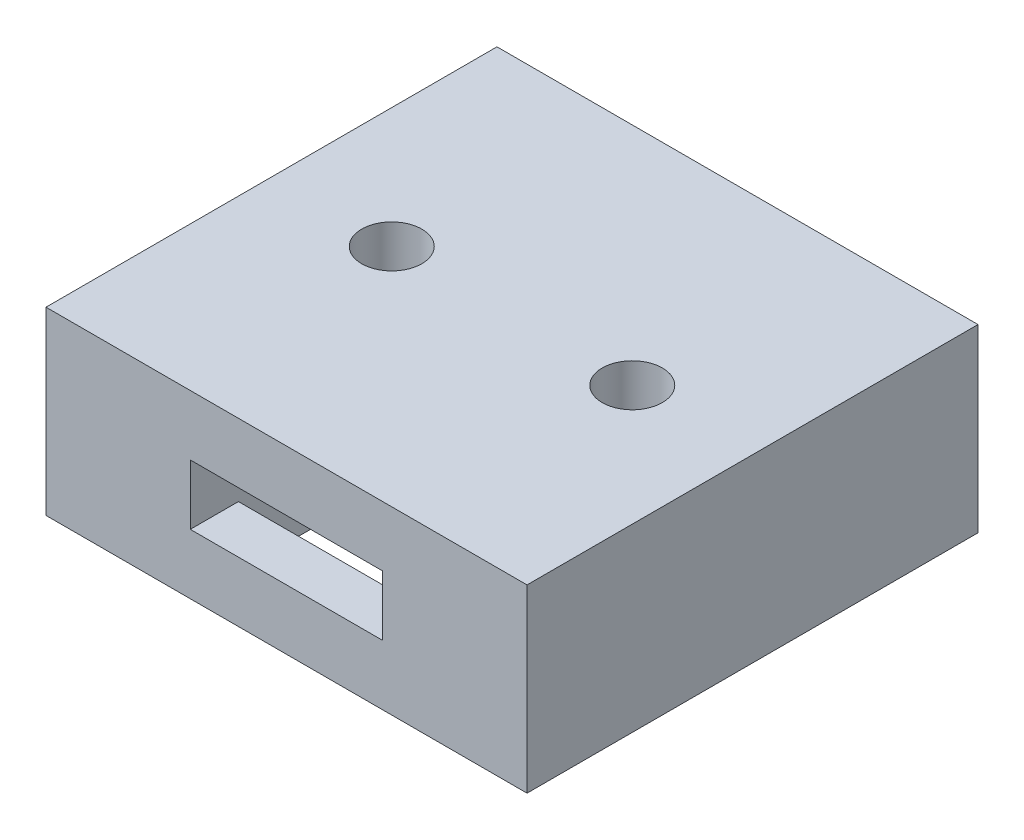
ISO-10303-21;
HEADER;
FILE_DESCRIPTION(('STEP AP214'),'2;1');
FILE_NAME('part.step','',(''),(''),'','','');
FILE_SCHEMA(('AUTOMOTIVE_DESIGN { 1 0 10303 214 1 1 1 1 }'));
ENDSEC;
DATA;
#1=APPLICATION_CONTEXT('core data for automotive mechanical design processes');
#2=APPLICATION_PROTOCOL_DEFINITION('international standard','automotive_design',2000,#1);
#3=PRODUCT_CONTEXT('',#1,'mechanical');
#4=PRODUCT('Part','Part','',(#3));
#5=PRODUCT_RELATED_PRODUCT_CATEGORY('part','',(#4));
#6=PRODUCT_DEFINITION_FORMATION('','',#4);
#7=PRODUCT_DEFINITION_CONTEXT('part definition',#1,'design');
#8=PRODUCT_DEFINITION('design','',#6,#7);
#9=PRODUCT_DEFINITION_SHAPE('','',#8);
#10=(LENGTH_UNIT() NAMED_UNIT(*) SI_UNIT(.MILLI.,.METRE.));
#11=(NAMED_UNIT(*) PLANE_ANGLE_UNIT() SI_UNIT($,.RADIAN.));
#12=(NAMED_UNIT(*) SI_UNIT($,.STERADIAN.) SOLID_ANGLE_UNIT());
#13=UNCERTAINTY_MEASURE_WITH_UNIT(LENGTH_MEASURE(1.E-05),#10,'distance_accuracy_value','');
#14=(GEOMETRIC_REPRESENTATION_CONTEXT(3) GLOBAL_UNCERTAINTY_ASSIGNED_CONTEXT((#13)) GLOBAL_UNIT_ASSIGNED_CONTEXT((#10,
#11,#12)) REPRESENTATION_CONTEXT('',''));
#15=CARTESIAN_POINT('',(0.,0.,0.));
#16=DIRECTION('',(0.,0.,1.));
#17=DIRECTION('',(1.,0.,0.));
#18=AXIS2_PLACEMENT_3D('',#15,#16,#17);
#19=CARTESIAN_POINT('',(-3.2,-26.,4.9));
#20=DIRECTION('',(-1.,0.,0.));
#21=DIRECTION('',(0.,0.,1.));
#22=AXIS2_PLACEMENT_3D('',#19,#20,#21);
#23=PLANE('',#22);
#24=DIRECTION('',(0.,1.,0.));
#25=VECTOR('',#24,1.);
#26=CARTESIAN_POINT('',(-3.2,-26.,2.9));
#27=LINE('',#26,#25);
#28=CARTESIAN_POINT('',(-3.2,0.,2.9));
#29=VERTEX_POINT('',#28);
#30=CARTESIAN_POINT('',(-3.2,4.,2.9));
#31=VERTEX_POINT('',#30);
#32=EDGE_CURVE('E186',#29,#31,#27,.T.);
#33=ORIENTED_EDGE('',*,*,#32,.T.);
#34=DIRECTION('',(0.,0.,1.));
#35=VECTOR('',#34,1.);
#36=CARTESIAN_POINT('',(-3.2,4.,2.9));
#37=LINE('',#36,#35);
#38=CARTESIAN_POINT('',(-3.2,4.,7.5));
#39=VERTEX_POINT('',#38);
#40=EDGE_CURVE('E171',#31,#39,#37,.T.);
#41=ORIENTED_EDGE('',*,*,#40,.T.);
#42=DIRECTION('',(0.,1.,0.));
#43=VECTOR('',#42,1.);
#44=CARTESIAN_POINT('',(-3.2,2.,7.5));
#45=LINE('',#44,#43);
#46=CARTESIAN_POINT('',(-3.2,2.,7.5));
#47=VERTEX_POINT('',#46);
#48=EDGE_CURVE('E301',#47,#39,#45,.T.);
#49=ORIENTED_EDGE('',*,*,#48,.F.);
#50=DIRECTION('',(0.,0.,1.));
#51=VECTOR('',#50,1.);
#52=CARTESIAN_POINT('',(-3.2,2.,2.9));
#53=LINE('',#52,#51);
#54=CARTESIAN_POINT('',(-3.2,2.,5.9));
#55=VERTEX_POINT('',#54);
#56=EDGE_CURVE('E315',#55,#47,#53,.T.);
#57=ORIENTED_EDGE('',*,*,#56,.F.);
#58=DIRECTION('',(0.,-0.707106781186548,-0.707106781186547));
#59=VECTOR('',#58,1.);
#60=CARTESIAN_POINT('',(-3.2,-12.5,-8.6));
#61=LINE('',#60,#59);
#62=CARTESIAN_POINT('',(-3.2,1.,4.9));
#63=VERTEX_POINT('',#62);
#64=EDGE_CURVE('E44',#55,#63,#61,.T.);
#65=ORIENTED_EDGE('',*,*,#64,.T.);
#66=DIRECTION('',(0.,1.,0.));
#67=VECTOR('',#66,1.);
#68=CARTESIAN_POINT('',(-3.2,-26.,4.9));
#69=LINE('',#68,#67);
#70=CARTESIAN_POINT('',(-3.2,0.,4.9));
#71=VERTEX_POINT('',#70);
#72=EDGE_CURVE('E189',#71,#63,#69,.T.);
#73=ORIENTED_EDGE('',*,*,#72,.F.);
#74=DIRECTION('',(0.,0.,-1.));
#75=VECTOR('',#74,1.);
#76=CARTESIAN_POINT('',(-3.2,0.,0.));
#77=LINE('',#76,#75);
#78=EDGE_CURVE('E260',#71,#29,#77,.T.);
#79=ORIENTED_EDGE('',*,*,#78,.T.);
#80=EDGE_LOOP('',(#33,#41,#49,#57,#65,#73,#79));
#81=FACE_BOUND('',#80,.T.);
#82=ADVANCED_FACE('F35',(#81),#23,.F.);
#83=CARTESIAN_POINT('',(3.2,-26.,2.9));
#84=DIRECTION('',(0.,0.,-1.));
#85=DIRECTION('',(-1.,0.,0.));
#86=AXIS2_PLACEMENT_3D('',#83,#84,#85);
#87=PLANE('',#86);
#88=DIRECTION('',(-1.,0.,0.));
#89=VECTOR('',#88,1.);
#90=CARTESIAN_POINT('',(-3.2,4.,2.9));
#91=LINE('',#90,#89);
#92=CARTESIAN_POINT('',(3.2,4.,2.9));
#93=VERTEX_POINT('',#92);
#94=EDGE_CURVE('E175',#93,#31,#91,.T.);
#95=ORIENTED_EDGE('',*,*,#94,.T.);
#96=ORIENTED_EDGE('',*,*,#32,.F.);
#97=DIRECTION('',(1.,0.,0.));
#98=VECTOR('',#97,1.);
#99=CARTESIAN_POINT('',(0.,0.,2.9));
#100=LINE('',#99,#98);
#101=CARTESIAN_POINT('',(3.2,0.,2.9));
#102=VERTEX_POINT('',#101);
#103=EDGE_CURVE('E184',#29,#102,#100,.T.);
#104=ORIENTED_EDGE('',*,*,#103,.T.);
#105=DIRECTION('',(0.,1.,0.));
#106=VECTOR('',#105,1.);
#107=CARTESIAN_POINT('',(3.2,-26.,2.9));
#108=LINE('',#107,#106);
#109=EDGE_CURVE('E164',#102,#93,#108,.T.);
#110=ORIENTED_EDGE('',*,*,#109,.T.);
#111=EDGE_LOOP('',(#95,#96,#104,#110));
#112=FACE_BOUND('',#111,.T.);
#113=ADVANCED_FACE('F182',(#112),#87,.F.);
#114=CARTESIAN_POINT('',(3.2,-26.,4.89999999999999));
#115=DIRECTION('',(1.,0.,0.));
#116=DIRECTION('',(0.,0.,-1.));
#117=AXIS2_PLACEMENT_3D('',#114,#115,#116);
#118=PLANE('',#117);
#119=DIRECTION('',(0.,0.,1.));
#120=VECTOR('',#119,1.);
#121=CARTESIAN_POINT('',(3.2,4.,2.9));
#122=LINE('',#121,#120);
#123=CARTESIAN_POINT('',(3.2,4.,7.5));
#124=VERTEX_POINT('',#123);
#125=EDGE_CURVE('E160',#93,#124,#122,.T.);
#126=ORIENTED_EDGE('',*,*,#125,.F.);
#127=ORIENTED_EDGE('',*,*,#109,.F.);
#128=DIRECTION('',(0.,0.,1.));
#129=VECTOR('',#128,1.);
#130=CARTESIAN_POINT('',(3.2,0.,0.));
#131=LINE('',#130,#129);
#132=CARTESIAN_POINT('',(3.2,0.,4.89999999999999));
#133=VERTEX_POINT('',#132);
#134=EDGE_CURVE('E257',#102,#133,#131,.T.);
#135=ORIENTED_EDGE('',*,*,#134,.T.);
#136=DIRECTION('',(0.,1.,0.));
#137=VECTOR('',#136,1.);
#138=CARTESIAN_POINT('',(3.2,-26.,4.89999999999999));
#139=LINE('',#138,#137);
#140=CARTESIAN_POINT('',(3.2,1.,4.89999999999999));
#141=VERTEX_POINT('',#140);
#142=EDGE_CURVE('E187',#133,#141,#139,.T.);
#143=ORIENTED_EDGE('',*,*,#142,.T.);
#144=DIRECTION('',(0.,0.707106781186548,0.707106781186547));
#145=VECTOR('',#144,1.);
#146=CARTESIAN_POINT('',(3.2,-12.5,-8.60000000000001));
#147=LINE('',#146,#145);
#148=CARTESIAN_POINT('',(3.2,2.,5.89999999999999));
#149=VERTEX_POINT('',#148);
#150=EDGE_CURVE('E11',#141,#149,#147,.T.);
#151=ORIENTED_EDGE('',*,*,#150,.T.);
#152=DIRECTION('',(0.,0.,1.));
#153=VECTOR('',#152,1.);
#154=CARTESIAN_POINT('',(3.2,2.,2.9));
#155=LINE('',#154,#153);
#156=CARTESIAN_POINT('',(3.2,2.,7.5));
#157=VERTEX_POINT('',#156);
#158=EDGE_CURVE('E172',#149,#157,#155,.T.);
#159=ORIENTED_EDGE('',*,*,#158,.T.);
#160=DIRECTION('',(0.,-1.,0.));
#161=VECTOR('',#160,1.);
#162=CARTESIAN_POINT('',(3.2,2.,7.5));
#163=LINE('',#162,#161);
#164=EDGE_CURVE('E167',#124,#157,#163,.T.);
#165=ORIENTED_EDGE('',*,*,#164,.F.);
#166=EDGE_LOOP('',(#126,#127,#135,#143,#151,#159,#165));
#167=FACE_BOUND('',#166,.T.);
#168=ADVANCED_FACE('F162',(#167),#118,.F.);
#169=CARTESIAN_POINT('',(3.2,-26.,-4.9));
#170=DIRECTION('',(1.,0.,0.));
#171=DIRECTION('',(0.,0.,-1.));
#172=AXIS2_PLACEMENT_3D('',#169,#170,#171);
#173=PLANE('',#172);
#174=DIRECTION('',(0.,1.,0.));
#175=VECTOR('',#174,1.);
#176=CARTESIAN_POINT('',(3.2,-26.,-2.9));
#177=LINE('',#176,#175);
#178=CARTESIAN_POINT('',(3.2,0.,-2.9));
#179=VERTEX_POINT('',#178);
#180=CARTESIAN_POINT('',(3.2,4.,-2.9));
#181=VERTEX_POINT('',#180);
#182=EDGE_CURVE('E191',#179,#181,#177,.T.);
#183=ORIENTED_EDGE('',*,*,#182,.T.);
#184=DIRECTION('',(0.,0.,-1.));
#185=VECTOR('',#184,1.);
#186=CARTESIAN_POINT('',(3.2,4.,-2.9));
#187=LINE('',#186,#185);
#188=CARTESIAN_POINT('',(3.2,4.,-7.5));
#189=VERTEX_POINT('',#188);
#190=EDGE_CURVE('E306',#181,#189,#187,.T.);
#191=ORIENTED_EDGE('',*,*,#190,.T.);
#192=DIRECTION('',(0.,-1.,0.));
#193=VECTOR('',#192,1.);
#194=CARTESIAN_POINT('',(3.2,2.,-7.5));
#195=LINE('',#194,#193);
#196=CARTESIAN_POINT('',(3.2,2.,-7.5));
#197=VERTEX_POINT('',#196);
#198=EDGE_CURVE('E572',#189,#197,#195,.T.);
#199=ORIENTED_EDGE('',*,*,#198,.T.);
#200=DIRECTION('',(0.,0.,-1.));
#201=VECTOR('',#200,1.);
#202=CARTESIAN_POINT('',(3.2,2.,-2.9));
#203=LINE('',#202,#201);
#204=CARTESIAN_POINT('',(3.2,2.,-5.9));
#205=VERTEX_POINT('',#204);
#206=EDGE_CURVE('E283',#205,#197,#203,.T.);
#207=ORIENTED_EDGE('',*,*,#206,.F.);
#208=DIRECTION('',(0.,0.707106781186545,-0.70710678118655));
#209=VECTOR('',#208,1.);
#210=CARTESIAN_POINT('',(3.2,-12.4999999999999,8.6));
#211=LINE('',#210,#209);
#212=CARTESIAN_POINT('',(3.2,1.00000000000001,-4.9));
#213=VERTEX_POINT('',#212);
#214=EDGE_CURVE('E275',#205,#213,#211,.F.);
#215=ORIENTED_EDGE('',*,*,#214,.T.);
#216=DIRECTION('',(0.,1.,0.));
#217=VECTOR('',#216,1.);
#218=CARTESIAN_POINT('',(3.2,-26.,-4.9));
#219=LINE('',#218,#217);
#220=CARTESIAN_POINT('',(3.2,0.,-4.9));
#221=VERTEX_POINT('',#220);
#222=EDGE_CURVE('E203',#221,#213,#219,.T.);
#223=ORIENTED_EDGE('',*,*,#222,.F.);
#224=DIRECTION('',(0.,0.,1.));
#225=VECTOR('',#224,1.);
#226=CARTESIAN_POINT('',(3.2,0.,0.));
#227=LINE('',#226,#225);
#228=EDGE_CURVE('E255',#221,#179,#227,.T.);
#229=ORIENTED_EDGE('',*,*,#228,.T.);
#230=EDGE_LOOP('',(#183,#191,#199,#207,#215,#223,#229));
#231=FACE_BOUND('',#230,.T.);
#232=ADVANCED_FACE('F280',(#231),#173,.F.);
#233=CARTESIAN_POINT('',(3.2,-26.,-2.9));
#234=DIRECTION('',(0.,0.,1.));
#235=DIRECTION('',(1.,0.,0.));
#236=AXIS2_PLACEMENT_3D('',#233,#234,#235);
#237=PLANE('',#236);
#238=DIRECTION('',(1.,0.,0.));
#239=VECTOR('',#238,1.);
#240=CARTESIAN_POINT('',(-3.2,4.,-2.9));
#241=LINE('',#240,#239);
#242=CARTESIAN_POINT('',(-3.2,4.,-2.9));
#243=VERTEX_POINT('',#242);
#244=EDGE_CURVE('E180',#243,#181,#241,.T.);
#245=ORIENTED_EDGE('',*,*,#244,.T.);
#246=ORIENTED_EDGE('',*,*,#182,.F.);
#247=DIRECTION('',(-1.,0.,0.));
#248=VECTOR('',#247,1.);
#249=CARTESIAN_POINT('',(0.,0.,-2.9));
#250=LINE('',#249,#248);
#251=CARTESIAN_POINT('',(-3.2,0.,-2.9));
#252=VERTEX_POINT('',#251);
#253=EDGE_CURVE('E253',#179,#252,#250,.T.);
#254=ORIENTED_EDGE('',*,*,#253,.T.);
#255=DIRECTION('',(0.,1.,0.));
#256=VECTOR('',#255,1.);
#257=CARTESIAN_POINT('',(-3.2,-26.,-2.9));
#258=LINE('',#257,#256);
#259=EDGE_CURVE('E197',#252,#243,#258,.T.);
#260=ORIENTED_EDGE('',*,*,#259,.T.);
#261=EDGE_LOOP('',(#245,#246,#254,#260));
#262=FACE_BOUND('',#261,.T.);
#263=ADVANCED_FACE('F374',(#262),#237,.F.);
#264=CARTESIAN_POINT('',(-3.2,-26.,-4.9));
#265=DIRECTION('',(-1.,0.,0.));
#266=DIRECTION('',(0.,0.,1.));
#267=AXIS2_PLACEMENT_3D('',#264,#265,#266);
#268=PLANE('',#267);
#269=DIRECTION('',(0.,0.,-1.));
#270=VECTOR('',#269,1.);
#271=CARTESIAN_POINT('',(-3.2,4.,-2.9));
#272=LINE('',#271,#270);
#273=CARTESIAN_POINT('',(-3.2,4.,-7.5));
#274=VERTEX_POINT('',#273);
#275=EDGE_CURVE('E574',#243,#274,#272,.T.);
#276=ORIENTED_EDGE('',*,*,#275,.F.);
#277=ORIENTED_EDGE('',*,*,#259,.F.);
#278=DIRECTION('',(0.,0.,-1.));
#279=VECTOR('',#278,1.);
#280=CARTESIAN_POINT('',(-3.2,0.,0.));
#281=LINE('',#280,#279);
#282=CARTESIAN_POINT('',(-3.2,0.,-4.9));
#283=VERTEX_POINT('',#282);
#284=EDGE_CURVE('E250',#252,#283,#281,.T.);
#285=ORIENTED_EDGE('',*,*,#284,.T.);
#286=DIRECTION('',(0.,1.,0.));
#287=VECTOR('',#286,1.);
#288=CARTESIAN_POINT('',(-3.2,-26.,-4.9));
#289=LINE('',#288,#287);
#290=CARTESIAN_POINT('',(-3.2,1.00000000000001,-4.9));
#291=VERTEX_POINT('',#290);
#292=EDGE_CURVE('E200',#283,#291,#289,.T.);
#293=ORIENTED_EDGE('',*,*,#292,.T.);
#294=DIRECTION('',(0.,-0.707106781186545,0.70710678118655));
#295=VECTOR('',#294,1.);
#296=CARTESIAN_POINT('',(-3.19999999999999,-12.4999999999999,8.6));
#297=LINE('',#296,#295);
#298=CARTESIAN_POINT('',(-3.2,2.,-5.9));
#299=VERTEX_POINT('',#298);
#300=EDGE_CURVE('E273',#291,#299,#297,.F.);
#301=ORIENTED_EDGE('',*,*,#300,.T.);
#302=DIRECTION('',(0.,0.,-1.));
#303=VECTOR('',#302,1.);
#304=CARTESIAN_POINT('',(-3.2,2.,-2.9));
#305=LINE('',#304,#303);
#306=CARTESIAN_POINT('',(-3.2,2.,-7.5));
#307=VERTEX_POINT('',#306);
#308=EDGE_CURVE('E294',#299,#307,#305,.T.);
#309=ORIENTED_EDGE('',*,*,#308,.T.);
#310=DIRECTION('',(0.,1.,0.));
#311=VECTOR('',#310,1.);
#312=CARTESIAN_POINT('',(-3.2,2.,-7.5));
#313=LINE('',#312,#311);
#314=EDGE_CURVE('E571',#307,#274,#313,.T.);
#315=ORIENTED_EDGE('',*,*,#314,.T.);
#316=EDGE_LOOP('',(#276,#277,#285,#293,#301,#309,#315));
#317=FACE_BOUND('',#316,.T.);
#318=ADVANCED_FACE('F293',(#317),#268,.F.);
#319=CARTESIAN_POINT('',(3.2,-26.,-4.9));
#320=DIRECTION('',(0.,0.,-1.));
#321=DIRECTION('',(-1.,0.,0.));
#322=AXIS2_PLACEMENT_3D('',#319,#320,#321);
#323=PLANE('',#322);
#324=ORIENTED_EDGE('',*,*,#222,.T.);
#325=DIRECTION('',(-1.,0.,0.));
#326=VECTOR('',#325,1.);
#327=CARTESIAN_POINT('',(3.2,1.00000000000001,-4.9));
#328=LINE('',#327,#326);
#329=EDGE_CURVE('E264',#213,#291,#328,.T.);
#330=ORIENTED_EDGE('',*,*,#329,.T.);
#331=ORIENTED_EDGE('',*,*,#292,.F.);
#332=DIRECTION('',(1.,0.,0.));
#333=VECTOR('',#332,1.);
#334=CARTESIAN_POINT('',(0.,0.,-4.9));
#335=LINE('',#334,#333);
#336=EDGE_CURVE('E248',#283,#221,#335,.T.);
#337=ORIENTED_EDGE('',*,*,#336,.T.);
#338=EDGE_LOOP('',(#324,#330,#331,#337));
#339=FACE_BOUND('',#338,.T.);
#340=ADVANCED_FACE('F288',(#339),#323,.F.);
#341=CARTESIAN_POINT('',(8.,6.,7.5));
#342=DIRECTION('',(0.,0.,-1.));
#343=DIRECTION('',(-1.,0.,0.));
#344=AXIS2_PLACEMENT_3D('',#341,#342,#343);
#345=PLANE('',#344);
#346=DIRECTION('',(1.,0.,0.));
#347=VECTOR('',#346,1.);
#348=CARTESIAN_POINT('',(8.,0.,7.5));
#349=LINE('',#348,#347);
#350=CARTESIAN_POINT('',(-8.,0.,7.5));
#351=VERTEX_POINT('',#350);
#352=CARTESIAN_POINT('',(8.,0.,7.5));
#353=VERTEX_POINT('',#352);
#354=EDGE_CURVE('E232',#351,#353,#349,.T.);
#355=ORIENTED_EDGE('',*,*,#354,.T.);
#356=DIRECTION('',(0.,-1.,0.));
#357=VECTOR('',#356,1.);
#358=CARTESIAN_POINT('',(8.,6.,7.5));
#359=LINE('',#358,#357);
#360=CARTESIAN_POINT('',(8.,6.,7.5));
#361=VERTEX_POINT('',#360);
#362=EDGE_CURVE('E242',#361,#353,#359,.T.);
#363=ORIENTED_EDGE('',*,*,#362,.F.);
#364=DIRECTION('',(1.,0.,0.));
#365=VECTOR('',#364,1.);
#366=CARTESIAN_POINT('',(8.,6.,7.5));
#367=LINE('',#366,#365);
#368=CARTESIAN_POINT('',(-8.,6.,7.5));
#369=VERTEX_POINT('',#368);
#370=EDGE_CURVE('E222',#369,#361,#367,.T.);
#371=ORIENTED_EDGE('',*,*,#370,.F.);
#372=DIRECTION('',(0.,-1.,0.));
#373=VECTOR('',#372,1.);
#374=CARTESIAN_POINT('',(-8.,6.,7.5));
#375=LINE('',#374,#373);
#376=EDGE_CURVE('E245',#369,#351,#375,.T.);
#377=ORIENTED_EDGE('',*,*,#376,.T.);
#378=EDGE_LOOP('',(#355,#363,#371,#377));
#379=FACE_BOUND('',#378,.T.);
#380=ORIENTED_EDGE('',*,*,#48,.T.);
#381=DIRECTION('',(1.,0.,0.));
#382=VECTOR('',#381,1.);
#383=CARTESIAN_POINT('',(-3.2,4.,7.5));
#384=LINE('',#383,#382);
#385=EDGE_CURVE('E304',#39,#124,#384,.T.);
#386=ORIENTED_EDGE('',*,*,#385,.T.);
#387=ORIENTED_EDGE('',*,*,#164,.T.);
#388=DIRECTION('',(-1.,0.,0.));
#389=VECTOR('',#388,1.);
#390=CARTESIAN_POINT('',(-3.2,2.,7.5));
#391=LINE('',#390,#389);
#392=EDGE_CURVE('E312',#157,#47,#391,.T.);
#393=ORIENTED_EDGE('',*,*,#392,.T.);
#394=EDGE_LOOP('',(#380,#386,#387,#393));
#395=FACE_BOUND('',#394,.T.);
#396=ADVANCED_FACE('F330',(#379,#395),#345,.F.);
#397=CARTESIAN_POINT('',(3.2,-26.,4.89999999999999));
#398=DIRECTION('',(0.,0.,1.));
#399=DIRECTION('',(1.,0.,0.));
#400=AXIS2_PLACEMENT_3D('',#397,#398,#399);
#401=PLANE('',#400);
#402=ORIENTED_EDGE('',*,*,#72,.T.);
#403=DIRECTION('',(1.,0.,0.));
#404=VECTOR('',#403,1.);
#405=CARTESIAN_POINT('',(3.2,1.,4.89999999999999));
#406=LINE('',#405,#404);
#407=EDGE_CURVE('E57',#63,#141,#406,.T.);
#408=ORIENTED_EDGE('',*,*,#407,.T.);
#409=ORIENTED_EDGE('',*,*,#142,.F.);
#410=DIRECTION('',(-1.,0.,0.));
#411=VECTOR('',#410,1.);
#412=CARTESIAN_POINT('',(0.,0.,4.9));
#413=LINE('',#412,#411);
#414=EDGE_CURVE('E262',#133,#71,#413,.T.);
#415=ORIENTED_EDGE('',*,*,#414,.T.);
#416=EDGE_LOOP('',(#402,#408,#409,#415));
#417=FACE_BOUND('',#416,.T.);
#418=ADVANCED_FACE('F318',(#417),#401,.F.);
#419=CARTESIAN_POINT('',(0.,6.,0.));
#420=DIRECTION('',(0.,-1.,0.));
#421=DIRECTION('',(0.,0.,-1.));
#422=AXIS2_PLACEMENT_3D('',#419,#420,#421);
#423=PLANE('',#422);
#424=DIRECTION('',(0.,0.,1.));
#425=VECTOR('',#424,1.);
#426=CARTESIAN_POINT('',(-8.,6.,-7.5));
#427=LINE('',#426,#425);
#428=CARTESIAN_POINT('',(-8.,6.,-7.5));
#429=VERTEX_POINT('',#428);
#430=EDGE_CURVE('E219',#429,#369,#427,.T.);
#431=ORIENTED_EDGE('',*,*,#430,.T.);
#432=ORIENTED_EDGE('',*,*,#370,.T.);
#433=DIRECTION('',(0.,0.,-1.));
#434=VECTOR('',#433,1.);
#435=CARTESIAN_POINT('',(8.,6.,-7.5));
#436=LINE('',#435,#434);
#437=CARTESIAN_POINT('',(8.,6.,-7.5));
#438=VERTEX_POINT('',#437);
#439=EDGE_CURVE('E225',#361,#438,#436,.T.);
#440=ORIENTED_EDGE('',*,*,#439,.T.);
#441=DIRECTION('',(-1.,0.,0.));
#442=VECTOR('',#441,1.);
#443=CARTESIAN_POINT('',(8.,6.,-7.5));
#444=LINE('',#443,#442);
#445=EDGE_CURVE('E227',#438,#429,#444,.T.);
#446=ORIENTED_EDGE('',*,*,#445,.T.);
#447=EDGE_LOOP('',(#431,#432,#440,#446));
#448=FACE_BOUND('',#447,.T.);
#449=CARTESIAN_POINT('',(4.,6.,0.));
#450=DIRECTION('',(0.,1.,0.));
#451=DIRECTION('',(0.,0.,1.));
#452=AXIS2_PLACEMENT_3D('',#449,#450,#451);
#453=CIRCLE('',#452,1.);
#454=CARTESIAN_POINT('',(4.,6.,1.));
#455=VERTEX_POINT('',#454);
#456=EDGE_CURVE('E213',#455,#455,#453,.T.);
#457=ORIENTED_EDGE('',*,*,#456,.F.);
#458=EDGE_LOOP('',(#457));
#459=FACE_BOUND('',#458,.T.);
#460=CARTESIAN_POINT('',(-4.,6.,0.));
#461=DIRECTION('',(0.,1.,0.));
#462=DIRECTION('',(0.,0.,1.));
#463=AXIS2_PLACEMENT_3D('',#460,#461,#462);
#464=CIRCLE('',#463,1.);
#465=CARTESIAN_POINT('',(-4.,6.,1.));
#466=VERTEX_POINT('',#465);
#467=EDGE_CURVE('E206',#466,#466,#464,.T.);
#468=ORIENTED_EDGE('',*,*,#467,.F.);
#469=EDGE_LOOP('',(#468));
#470=FACE_BOUND('',#469,.T.);
#471=ADVANCED_FACE('F336',(#448,#459,#470),#423,.F.);
#472=CARTESIAN_POINT('',(0.,0.,0.));
#473=DIRECTION('',(0.,-1.,0.));
#474=DIRECTION('',(0.,0.,-1.));
#475=AXIS2_PLACEMENT_3D('',#472,#473,#474);
#476=PLANE('',#475);
#477=ORIENTED_EDGE('',*,*,#414,.F.);
#478=ORIENTED_EDGE('',*,*,#134,.F.);
#479=ORIENTED_EDGE('',*,*,#103,.F.);
#480=ORIENTED_EDGE('',*,*,#78,.F.);
#481=EDGE_LOOP('',(#477,#478,#479,#480));
#482=FACE_BOUND('',#481,.T.);
#483=ORIENTED_EDGE('',*,*,#228,.F.);
#484=ORIENTED_EDGE('',*,*,#336,.F.);
#485=ORIENTED_EDGE('',*,*,#284,.F.);
#486=ORIENTED_EDGE('',*,*,#253,.F.);
#487=EDGE_LOOP('',(#483,#484,#485,#486));
#488=FACE_BOUND('',#487,.T.);
#489=CARTESIAN_POINT('',(4.,0.,0.));
#490=DIRECTION('',(0.,1.,0.));
#491=DIRECTION('',(0.,0.,1.));
#492=AXIS2_PLACEMENT_3D('',#489,#490,#491);
#493=CIRCLE('',#492,1.);
#494=CARTESIAN_POINT('',(4.,0.,1.));
#495=VERTEX_POINT('',#494);
#496=EDGE_CURVE('E209',#495,#495,#493,.T.);
#497=ORIENTED_EDGE('',*,*,#496,.T.);
#498=EDGE_LOOP('',(#497));
#499=FACE_BOUND('',#498,.T.);
#500=DIRECTION('',(0.,0.,1.));
#501=VECTOR('',#500,1.);
#502=CARTESIAN_POINT('',(-8.,0.,-7.5));
#503=LINE('',#502,#501);
#504=CARTESIAN_POINT('',(-8.,0.,-7.5));
#505=VERTEX_POINT('',#504);
#506=EDGE_CURVE('E216',#505,#351,#503,.T.);
#507=ORIENTED_EDGE('',*,*,#506,.F.);
#508=DIRECTION('',(-1.,0.,0.));
#509=VECTOR('',#508,1.);
#510=CARTESIAN_POINT('',(8.,0.,-7.5));
#511=LINE('',#510,#509);
#512=CARTESIAN_POINT('',(8.,0.,-7.5));
#513=VERTEX_POINT('',#512);
#514=EDGE_CURVE('E223',#513,#505,#511,.T.);
#515=ORIENTED_EDGE('',*,*,#514,.F.);
#516=DIRECTION('',(0.,0.,-1.));
#517=VECTOR('',#516,1.);
#518=CARTESIAN_POINT('',(8.,0.,-7.5));
#519=LINE('',#518,#517);
#520=EDGE_CURVE('E234',#353,#513,#519,.T.);
#521=ORIENTED_EDGE('',*,*,#520,.F.);
#522=ORIENTED_EDGE('',*,*,#354,.F.);
#523=EDGE_LOOP('',(#507,#515,#521,#522));
#524=FACE_BOUND('',#523,.T.);
#525=CARTESIAN_POINT('',(-4.,0.,0.));
#526=DIRECTION('',(0.,1.,0.));
#527=DIRECTION('',(0.,0.,1.));
#528=AXIS2_PLACEMENT_3D('',#525,#526,#527);
#529=CIRCLE('',#528,1.);
#530=CARTESIAN_POINT('',(-4.,0.,1.));
#531=VERTEX_POINT('',#530);
#532=EDGE_CURVE('E210',#531,#531,#529,.T.);
#533=ORIENTED_EDGE('',*,*,#532,.T.);
#534=EDGE_LOOP('',(#533));
#535=FACE_BOUND('',#534,.T.);
#536=ADVANCED_FACE('F332',(#482,#488,#499,#524,#535),#476,.T.);
#537=CARTESIAN_POINT('',(-8.,6.,-7.5));
#538=DIRECTION('',(1.,0.,0.));
#539=DIRECTION('',(0.,0.,-1.));
#540=AXIS2_PLACEMENT_3D('',#537,#538,#539);
#541=PLANE('',#540);
#542=ORIENTED_EDGE('',*,*,#506,.T.);
#543=ORIENTED_EDGE('',*,*,#376,.F.);
#544=ORIENTED_EDGE('',*,*,#430,.F.);
#545=DIRECTION('',(0.,-1.,0.));
#546=VECTOR('',#545,1.);
#547=CARTESIAN_POINT('',(-8.,6.,-7.5));
#548=LINE('',#547,#546);
#549=EDGE_CURVE('E229',#429,#505,#548,.T.);
#550=ORIENTED_EDGE('',*,*,#549,.T.);
#551=EDGE_LOOP('',(#542,#543,#544,#550));
#552=FACE_BOUND('',#551,.T.);
#553=ADVANCED_FACE('F335',(#552),#541,.F.);
#554=CARTESIAN_POINT('',(8.,6.,-7.5));
#555=DIRECTION('',(-1.,0.,0.));
#556=DIRECTION('',(0.,0.,1.));
#557=AXIS2_PLACEMENT_3D('',#554,#555,#556);
#558=PLANE('',#557);
#559=ORIENTED_EDGE('',*,*,#520,.T.);
#560=DIRECTION('',(0.,-1.,0.));
#561=VECTOR('',#560,1.);
#562=CARTESIAN_POINT('',(8.,6.,-7.5));
#563=LINE('',#562,#561);
#564=EDGE_CURVE('E239',#438,#513,#563,.T.);
#565=ORIENTED_EDGE('',*,*,#564,.F.);
#566=ORIENTED_EDGE('',*,*,#439,.F.);
#567=ORIENTED_EDGE('',*,*,#362,.T.);
#568=EDGE_LOOP('',(#559,#565,#566,#567));
#569=FACE_BOUND('',#568,.T.);
#570=ADVANCED_FACE('F473',(#569),#558,.F.);
#571=CARTESIAN_POINT('',(8.,6.,-7.5));
#572=DIRECTION('',(0.,0.,1.));
#573=DIRECTION('',(1.,0.,0.));
#574=AXIS2_PLACEMENT_3D('',#571,#572,#573);
#575=PLANE('',#574);
#576=DIRECTION('',(1.,0.,0.));
#577=VECTOR('',#576,1.);
#578=CARTESIAN_POINT('',(-3.2,4.,-7.5));
#579=LINE('',#578,#577);
#580=EDGE_CURVE('E570',#274,#189,#579,.T.);
#581=ORIENTED_EDGE('',*,*,#580,.F.);
#582=ORIENTED_EDGE('',*,*,#314,.F.);
#583=DIRECTION('',(-1.,0.,0.));
#584=VECTOR('',#583,1.);
#585=CARTESIAN_POINT('',(-3.2,2.,-7.5));
#586=LINE('',#585,#584);
#587=EDGE_CURVE('E299',#197,#307,#586,.T.);
#588=ORIENTED_EDGE('',*,*,#587,.F.);
#589=ORIENTED_EDGE('',*,*,#198,.F.);
#590=EDGE_LOOP('',(#581,#582,#588,#589));
#591=FACE_BOUND('',#590,.T.);
#592=ORIENTED_EDGE('',*,*,#514,.T.);
#593=ORIENTED_EDGE('',*,*,#549,.F.);
#594=ORIENTED_EDGE('',*,*,#445,.F.);
#595=ORIENTED_EDGE('',*,*,#564,.T.);
#596=EDGE_LOOP('',(#592,#593,#594,#595));
#597=FACE_BOUND('',#596,.T.);
#598=ADVANCED_FACE('F357',(#591,#597),#575,.F.);
#599=CARTESIAN_POINT('',(4.,6.,0.));
#600=DIRECTION('',(0.,-1.,0.));
#601=DIRECTION('',(0.,0.,-1.));
#602=AXIS2_PLACEMENT_3D('',#599,#600,#601);
#603=CYLINDRICAL_SURFACE('',#602,1.);
#604=ORIENTED_EDGE('',*,*,#456,.T.);
#605=EDGE_LOOP('',(#604));
#606=FACE_BOUND('',#605,.T.);
#607=ORIENTED_EDGE('',*,*,#496,.F.);
#608=EDGE_LOOP('',(#607));
#609=FACE_BOUND('',#608,.T.);
#610=ADVANCED_FACE('F349',(#606,#609),#603,.F.);
#611=CARTESIAN_POINT('',(-4.,6.,0.));
#612=DIRECTION('',(0.,-1.,0.));
#613=DIRECTION('',(0.,0.,-1.));
#614=AXIS2_PLACEMENT_3D('',#611,#612,#613);
#615=CYLINDRICAL_SURFACE('',#614,1.);
#616=ORIENTED_EDGE('',*,*,#467,.T.);
#617=EDGE_LOOP('',(#616));
#618=FACE_BOUND('',#617,.T.);
#619=ORIENTED_EDGE('',*,*,#532,.F.);
#620=EDGE_LOOP('',(#619));
#621=FACE_BOUND('',#620,.T.);
#622=ADVANCED_FACE('F347',(#618,#621),#615,.F.);
#623=CARTESIAN_POINT('',(-3.2,4.,2.9));
#624=DIRECTION('',(0.,-1.,0.));
#625=DIRECTION('',(1.,0.,0.));
#626=AXIS2_PLACEMENT_3D('',#623,#624,#625);
#627=PLANE('',#626);
#628=ORIENTED_EDGE('',*,*,#40,.F.);
#629=ORIENTED_EDGE('',*,*,#94,.F.);
#630=ORIENTED_EDGE('',*,*,#125,.T.);
#631=ORIENTED_EDGE('',*,*,#385,.F.);
#632=EDGE_LOOP('',(#628,#629,#630,#631));
#633=FACE_BOUND('',#632,.T.);
#634=ADVANCED_FACE('F176',(#633),#627,.T.);
#635=CARTESIAN_POINT('',(-3.2,2.,2.9));
#636=DIRECTION('',(0.,1.,0.));
#637=DIRECTION('',(-1.,0.,0.));
#638=AXIS2_PLACEMENT_3D('',#635,#636,#637);
#639=PLANE('',#638);
#640=ORIENTED_EDGE('',*,*,#158,.F.);
#641=DIRECTION('',(-1.,0.,0.));
#642=VECTOR('',#641,1.);
#643=CARTESIAN_POINT('',(-3.2,2.,5.9));
#644=LINE('',#643,#642);
#645=EDGE_CURVE('E269',#149,#55,#644,.T.);
#646=ORIENTED_EDGE('',*,*,#645,.T.);
#647=ORIENTED_EDGE('',*,*,#56,.T.);
#648=ORIENTED_EDGE('',*,*,#392,.F.);
#649=EDGE_LOOP('',(#640,#646,#647,#648));
#650=FACE_BOUND('',#649,.T.);
#651=ADVANCED_FACE('F327',(#650),#639,.T.);
#652=CARTESIAN_POINT('',(-3.2,2.,-2.9));
#653=DIRECTION('',(0.,-1.,0.));
#654=DIRECTION('',(1.,0.,0.));
#655=AXIS2_PLACEMENT_3D('',#652,#653,#654);
#656=PLANE('',#655);
#657=ORIENTED_EDGE('',*,*,#308,.F.);
#658=DIRECTION('',(1.,0.,0.));
#659=VECTOR('',#658,1.);
#660=CARTESIAN_POINT('',(-3.2,2.,-5.9));
#661=LINE('',#660,#659);
#662=EDGE_CURVE('E267',#299,#205,#661,.T.);
#663=ORIENTED_EDGE('',*,*,#662,.T.);
#664=ORIENTED_EDGE('',*,*,#206,.T.);
#665=ORIENTED_EDGE('',*,*,#587,.T.);
#666=EDGE_LOOP('',(#657,#663,#664,#665));
#667=FACE_BOUND('',#666,.T.);
#668=ADVANCED_FACE('F297',(#667),#656,.F.);
#669=CARTESIAN_POINT('',(-3.2,4.,-2.9));
#670=DIRECTION('',(0.,1.,0.));
#671=DIRECTION('',(-1.,0.,0.));
#672=AXIS2_PLACEMENT_3D('',#669,#670,#671);
#673=PLANE('',#672);
#674=ORIENTED_EDGE('',*,*,#275,.T.);
#675=ORIENTED_EDGE('',*,*,#580,.T.);
#676=ORIENTED_EDGE('',*,*,#190,.F.);
#677=ORIENTED_EDGE('',*,*,#244,.F.);
#678=EDGE_LOOP('',(#674,#675,#676,#677));
#679=FACE_BOUND('',#678,.T.);
#680=ADVANCED_FACE('F411',(#679),#673,.F.);
#681=CARTESIAN_POINT('',(3.2,1.00000000000001,-4.9));
#682=DIRECTION('',(0.,-0.70710678118655,-0.707106781186545));
#683=DIRECTION('',(-1.,0.,0.));
#684=AXIS2_PLACEMENT_3D('',#681,#682,#683);
#685=PLANE('',#684);
#686=ORIENTED_EDGE('',*,*,#214,.F.);
#687=ORIENTED_EDGE('',*,*,#662,.F.);
#688=ORIENTED_EDGE('',*,*,#300,.F.);
#689=ORIENTED_EDGE('',*,*,#329,.F.);
#690=EDGE_LOOP('',(#686,#687,#688,#689));
#691=FACE_BOUND('',#690,.T.);
#692=ADVANCED_FACE('F290',(#691),#685,.F.);
#693=CARTESIAN_POINT('',(-3.2,2.,5.9));
#694=DIRECTION('',(0.,0.707106781186547,-0.707106781186548));
#695=DIRECTION('',(1.,0.,0.));
#696=AXIS2_PLACEMENT_3D('',#693,#694,#695);
#697=PLANE('',#696);
#698=ORIENTED_EDGE('',*,*,#150,.F.);
#699=ORIENTED_EDGE('',*,*,#407,.F.);
#700=ORIENTED_EDGE('',*,*,#64,.F.);
#701=ORIENTED_EDGE('',*,*,#645,.F.);
#702=EDGE_LOOP('',(#698,#699,#700,#701));
#703=FACE_BOUND('',#702,.T.);
#704=ADVANCED_FACE('F38',(#703),#697,.T.);
#705=CLOSED_SHELL('',(#82,#113,#168,#232,#263,#318,#340,#396,#418,#471,#536,#553,#570,#598,#610,
#622,#634,#651,#668,#680,#692,#704));
#706=MANIFOLD_SOLID_BREP('B2',#705);
#707=ADVANCED_BREP_SHAPE_REPRESENTATION('',(#18,#706),#14);
#708=SHAPE_DEFINITION_REPRESENTATION(#9,#707);
ENDSEC;
END-ISO-10303-21;
